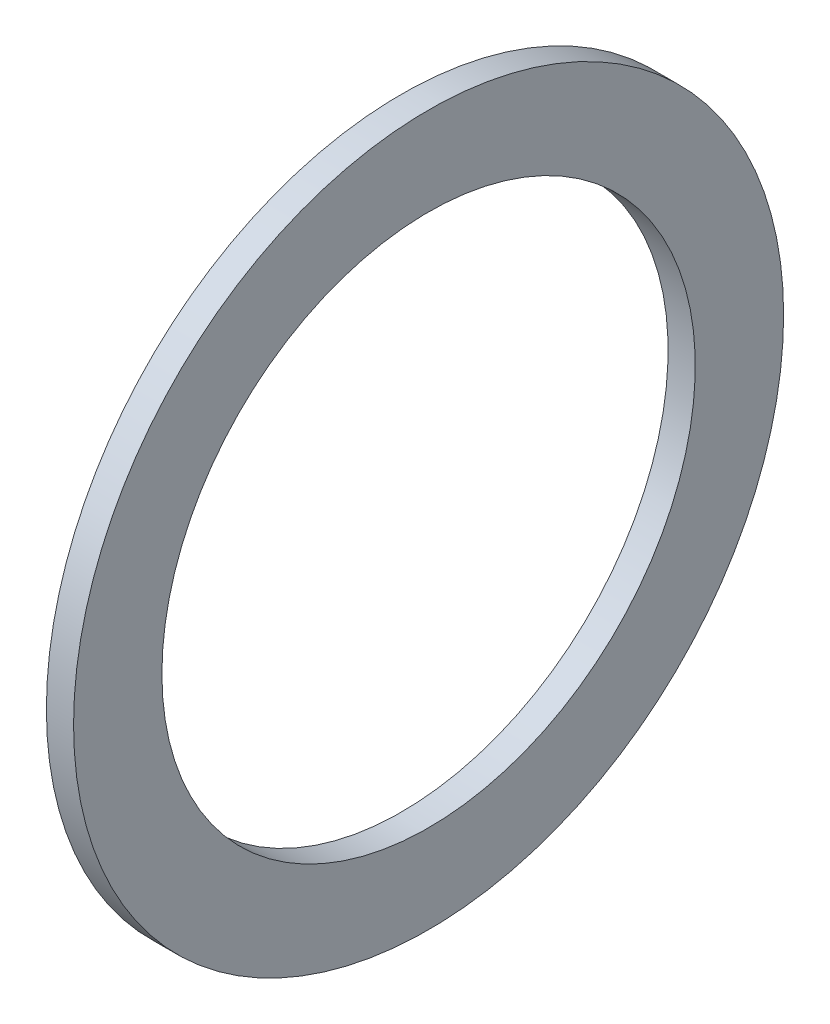
ISO-10303-21;
HEADER;
FILE_DESCRIPTION(('STEP AP214'),'2;1');
FILE_NAME('part.step','',(''),(''),'','','');
FILE_SCHEMA(('AUTOMOTIVE_DESIGN { 1 0 10303 214 1 1 1 1 }'));
ENDSEC;
DATA;
#1=APPLICATION_CONTEXT('core data for automotive mechanical design processes');
#2=APPLICATION_PROTOCOL_DEFINITION('international standard','automotive_design',2000,#1);
#3=PRODUCT_CONTEXT('',#1,'mechanical');
#4=PRODUCT('Part','Part','',(#3));
#5=PRODUCT_RELATED_PRODUCT_CATEGORY('part','',(#4));
#6=PRODUCT_DEFINITION_FORMATION('','',#4);
#7=PRODUCT_DEFINITION_CONTEXT('part definition',#1,'design');
#8=PRODUCT_DEFINITION('design','',#6,#7);
#9=PRODUCT_DEFINITION_SHAPE('','',#8);
#10=(LENGTH_UNIT() NAMED_UNIT(*) SI_UNIT(.MILLI.,.METRE.));
#11=(NAMED_UNIT(*) PLANE_ANGLE_UNIT() SI_UNIT($,.RADIAN.));
#12=(NAMED_UNIT(*) SI_UNIT($,.STERADIAN.) SOLID_ANGLE_UNIT());
#13=UNCERTAINTY_MEASURE_WITH_UNIT(LENGTH_MEASURE(1.E-05),#10,'distance_accuracy_value','');
#14=(GEOMETRIC_REPRESENTATION_CONTEXT(3) GLOBAL_UNCERTAINTY_ASSIGNED_CONTEXT((#13)) GLOBAL_UNIT_ASSIGNED_CONTEXT((#10,
#11,#12)) REPRESENTATION_CONTEXT('',''));
#15=CARTESIAN_POINT('',(0.,0.,0.));
#16=DIRECTION('',(0.,0.,1.));
#17=DIRECTION('',(1.,0.,0.));
#18=AXIS2_PLACEMENT_3D('',#15,#16,#17);
#19=CARTESIAN_POINT('',(0.,-19.939,0.));
#20=DIRECTION('',(-1.,0.,0.));
#21=DIRECTION('',(0.,0.,1.));
#22=AXIS2_PLACEMENT_3D('',#19,#20,#21);
#23=PLANE('',#22);
#24=CARTESIAN_POINT('',(0.,0.,0.));
#25=DIRECTION('',(-1.,0.,0.));
#26=DIRECTION('',(0.,0.,1.));
#27=AXIS2_PLACEMENT_3D('',#24,#25,#26);
#28=CIRCLE('',#27,26.543);
#29=CARTESIAN_POINT('',(0.,0.,26.543));
#30=VERTEX_POINT('',#29);
#31=EDGE_CURVE('E10',#30,#30,#28,.T.);
#32=ORIENTED_EDGE('',*,*,#31,.T.);
#33=EDGE_LOOP('',(#32));
#34=FACE_BOUND('',#33,.T.);
#35=CARTESIAN_POINT('',(0.,0.,0.));
#36=DIRECTION('',(-1.,0.,0.));
#37=DIRECTION('',(0.,0.,1.));
#38=AXIS2_PLACEMENT_3D('',#35,#36,#37);
#39=CIRCLE('',#38,19.939);
#40=CARTESIAN_POINT('',(0.,0.,19.939));
#41=VERTEX_POINT('',#40);
#42=EDGE_CURVE('E43',#41,#41,#39,.T.);
#43=ORIENTED_EDGE('',*,*,#42,.F.);
#44=EDGE_LOOP('',(#43));
#45=FACE_BOUND('',#44,.T.);
#46=ADVANCED_FACE('F29',(#34,#45),#23,.T.);
#47=CARTESIAN_POINT('',(-43.7165807560137,0.,0.));
#48=DIRECTION('',(-1.,0.,0.));
#49=DIRECTION('',(0.,0.,1.));
#50=AXIS2_PLACEMENT_3D('',#47,#48,#49);
#51=CYLINDRICAL_SURFACE('',#50,26.543);
#52=CARTESIAN_POINT('',(2.032,0.,0.));
#53=DIRECTION('',(-1.,0.,0.));
#54=DIRECTION('',(0.,0.,1.));
#55=AXIS2_PLACEMENT_3D('',#52,#53,#54);
#56=CIRCLE('',#55,26.543);
#57=CARTESIAN_POINT('',(2.032,0.,26.543));
#58=VERTEX_POINT('',#57);
#59=EDGE_CURVE('E35',#58,#58,#56,.T.);
#60=ORIENTED_EDGE('',*,*,#59,.T.);
#61=EDGE_LOOP('',(#60));
#62=FACE_BOUND('',#61,.T.);
#63=ORIENTED_EDGE('',*,*,#31,.F.);
#64=EDGE_LOOP('',(#63));
#65=FACE_BOUND('',#64,.T.);
#66=ADVANCED_FACE('F53',(#62,#65),#51,.T.);
#67=CARTESIAN_POINT('',(2.032,-19.939,0.));
#68=DIRECTION('',(1.,0.,0.));
#69=DIRECTION('',(0.,0.,-1.));
#70=AXIS2_PLACEMENT_3D('',#67,#68,#69);
#71=PLANE('',#70);
#72=CARTESIAN_POINT('',(2.032,0.,0.));
#73=DIRECTION('',(-1.,0.,0.));
#74=DIRECTION('',(0.,0.,1.));
#75=AXIS2_PLACEMENT_3D('',#72,#73,#74);
#76=CIRCLE('',#75,19.939);
#77=CARTESIAN_POINT('',(2.032,0.,19.939));
#78=VERTEX_POINT('',#77);
#79=EDGE_CURVE('E39',#78,#78,#76,.T.);
#80=ORIENTED_EDGE('',*,*,#79,.T.);
#81=EDGE_LOOP('',(#80));
#82=FACE_BOUND('',#81,.T.);
#83=ORIENTED_EDGE('',*,*,#59,.F.);
#84=EDGE_LOOP('',(#83));
#85=FACE_BOUND('',#84,.T.);
#86=ADVANCED_FACE('F57',(#82,#85),#71,.T.);
#87=CARTESIAN_POINT('',(-43.7165807560137,0.,0.));
#88=DIRECTION('',(-1.,0.,0.));
#89=DIRECTION('',(0.,0.,1.));
#90=AXIS2_PLACEMENT_3D('',#87,#88,#89);
#91=CYLINDRICAL_SURFACE('',#90,19.939);
#92=ORIENTED_EDGE('',*,*,#42,.T.);
#93=EDGE_LOOP('',(#92));
#94=FACE_BOUND('',#93,.T.);
#95=ORIENTED_EDGE('',*,*,#79,.F.);
#96=EDGE_LOOP('',(#95));
#97=FACE_BOUND('',#96,.T.);
#98=ADVANCED_FACE('F49',(#94,#97),#91,.F.);
#99=CLOSED_SHELL('',(#46,#66,#86,#98));
#100=MANIFOLD_SOLID_BREP('B2',#99);
#101=ADVANCED_BREP_SHAPE_REPRESENTATION('',(#18,#100),#14);
#102=SHAPE_DEFINITION_REPRESENTATION(#9,#101);
ENDSEC;
END-ISO-10303-21;
